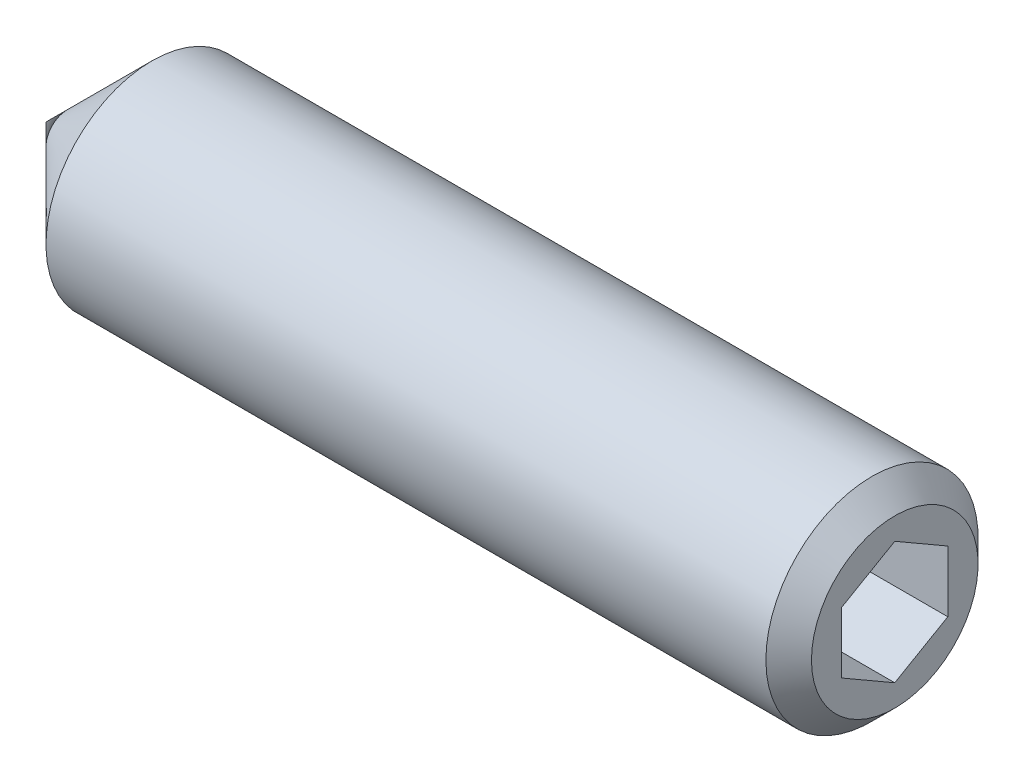
ISO-10303-21;
HEADER;
FILE_DESCRIPTION(('STEP AP214'),'2;1');
FILE_NAME('part.step','',(''),(''),'','','');
FILE_SCHEMA(('AUTOMOTIVE_DESIGN { 1 0 10303 214 1 1 1 1 }'));
ENDSEC;
DATA;
#1=APPLICATION_CONTEXT('core data for automotive mechanical design processes');
#2=APPLICATION_PROTOCOL_DEFINITION('international standard','automotive_design',2000,#1);
#3=PRODUCT_CONTEXT('',#1,'mechanical');
#4=PRODUCT('Part','Part','',(#3));
#5=PRODUCT_RELATED_PRODUCT_CATEGORY('part','',(#4));
#6=PRODUCT_DEFINITION_FORMATION('','',#4);
#7=PRODUCT_DEFINITION_CONTEXT('part definition',#1,'design');
#8=PRODUCT_DEFINITION('design','',#6,#7);
#9=PRODUCT_DEFINITION_SHAPE('','',#8);
#10=(LENGTH_UNIT() NAMED_UNIT(*) SI_UNIT(.MILLI.,.METRE.));
#11=(NAMED_UNIT(*) PLANE_ANGLE_UNIT() SI_UNIT($,.RADIAN.));
#12=(NAMED_UNIT(*) SI_UNIT($,.STERADIAN.) SOLID_ANGLE_UNIT());
#13=UNCERTAINTY_MEASURE_WITH_UNIT(LENGTH_MEASURE(1.E-05),#10,'distance_accuracy_value','');
#14=(GEOMETRIC_REPRESENTATION_CONTEXT(3) GLOBAL_UNCERTAINTY_ASSIGNED_CONTEXT((#13)) GLOBAL_UNIT_ASSIGNED_CONTEXT((#10,
#11,#12)) REPRESENTATION_CONTEXT('',''));
#15=CARTESIAN_POINT('',(0.,0.,0.));
#16=DIRECTION('',(0.,0.,1.));
#17=DIRECTION('',(1.,0.,0.));
#18=AXIS2_PLACEMENT_3D('',#15,#16,#17);
#19=CARTESIAN_POINT('',(16.,-0.577350269189623,-0.999999999999998));
#20=DIRECTION('',(0.,0.,-1.));
#21=DIRECTION('',(-1.,0.,0.));
#22=AXIS2_PLACEMENT_3D('',#19,#20,#21);
#23=PLANE('',#22);
#24=DIRECTION('',(1.,0.,0.));
#25=VECTOR('',#24,1.);
#26=CARTESIAN_POINT('',(16.,-0.577350269189624,-0.999999999999995));
#27=LINE('',#26,#25);
#28=CARTESIAN_POINT('',(13.5000000009061,-0.57735026912423,-0.999999999886733));
#29=VERTEX_POINT('',#28);
#30=CARTESIAN_POINT('',(16.,-0.577350269189624,-0.999999999999996));
#31=VERTEX_POINT('',#30);
#32=EDGE_CURVE('E76',#29,#31,#27,.T.);
#33=ORIENTED_EDGE('',*,*,#32,.T.);
#34=DIRECTION('',(0.,1.,0.));
#35=VECTOR('',#34,1.);
#36=CARTESIAN_POINT('',(16.,-0.577350269189623,-0.999999999999998));
#37=LINE('',#36,#35);
#38=CARTESIAN_POINT('',(16.,0.577350269189624,-0.999999999999996));
#39=VERTEX_POINT('',#38);
#40=EDGE_CURVE('E82',#39,#31,#37,.F.);
#41=ORIENTED_EDGE('',*,*,#40,.F.);
#42=DIRECTION('',(1.,0.,0.));
#43=VECTOR('',#42,1.);
#44=CARTESIAN_POINT('',(16.,0.577350269189624,-0.999999999999995));
#45=LINE('',#44,#43);
#46=CARTESIAN_POINT('',(13.5000000009439,0.577350269058838,-0.999999999999997));
#47=VERTEX_POINT('',#46);
#48=EDGE_CURVE('E79',#39,#47,#45,.F.);
#49=ORIENTED_EDGE('',*,*,#48,.T.);
#50=CARTESIAN_POINT('',(13.5000000007965,-0.5773502689597,-1.00000000018141));
#51=CARTESIAN_POINT('',(13.4853477733828,-0.526608173396974,-1.00000000006515));
#52=CARTESIAN_POINT('',(13.4720223393553,-0.475428072795128,-1.00000000001746));
#53=CARTESIAN_POINT('',(13.4487631944525,-0.372181722387194,-0.999999999982494));
#54=CARTESIAN_POINT('',(13.438837710883,-0.320113638690416,-0.999999999995364));
#55=CARTESIAN_POINT('',(13.4233879801396,-0.216622724957149,-1.00000000000452));
#56=CARTESIAN_POINT('',(13.4177608944549,-0.165215813863969,-1.0000000000012));
#57=CARTESIAN_POINT('',(13.4110445847173,-0.0621602313734194,-0.999999999998795));
#58=CARTESIAN_POINT('',(13.4099497976449,-0.0105119342980575,-0.999999999999696));
#59=CARTESIAN_POINT('',(13.4122331457619,0.0859873680358365,-1.00000000000026));
#60=CARTESIAN_POINT('',(13.4150506433072,0.130852853801168,-1.00000000000007));
#61=CARTESIAN_POINT('',(13.4239786510911,0.220291541325074,-0.999999999999927));
#62=CARTESIAN_POINT('',(13.4300922081347,0.264864433969996,-0.999999999999978));
#63=CARTESIAN_POINT('',(13.4453749174606,0.354487373624506,-1.00000000000002));
#64=CARTESIAN_POINT('',(13.4546088219235,0.39952608336362,-1.00000000000001));
#65=CARTESIAN_POINT('',(13.4755658812825,0.488931944768837,-0.999999999999988));
#66=CARTESIAN_POINT('',(13.4872841152643,0.533300240943821,-0.999999999999977));
#67=CARTESIAN_POINT('',(13.5000000009144,0.577350268956905,-0.999999999999998));
#68=B_SPLINE_CURVE_WITH_KNOTS('',3,(#50,#51,#52,#53,#54,#55,#56,#57,#58,#59,#60,#61,#62,#63,#64,
#65,#66,#67),.UNSPECIFIED.,.F.,.F.,(4,2,2,2,2,2,2,2,4),(0.,0.158508005822943,0.317396908609176,
0.472353803200606,0.627120444598494,0.76185389132548,0.896712096768139,1.03456081098711,
1.1721389863695),.UNSPECIFIED.);
#69=EDGE_CURVE('E19',#29,#47,#68,.T.);
#70=ORIENTED_EDGE('',*,*,#69,.F.);
#71=EDGE_LOOP('',(#33,#41,#49,#70));
#72=FACE_BOUND('',#71,.T.);
#73=ADVANCED_FACE('F15',(#72),#23,.F.);
#74=CARTESIAN_POINT('',(16.,-1.15470053837925,0.));
#75=DIRECTION('',(0.,-0.866025403784437,-0.500000000000003));
#76=DIRECTION('',(0.,0.500000000000003,-0.866025403784437));
#77=AXIS2_PLACEMENT_3D('',#74,#75,#76);
#78=PLANE('',#77);
#79=DIRECTION('',(1.,0.,0.));
#80=VECTOR('',#79,1.);
#81=CARTESIAN_POINT('',(16.,-1.15470053837925,0.));
#82=LINE('',#81,#80);
#83=CARTESIAN_POINT('',(13.5000000009442,-1.15470053831437,-1.12366323968362E-10));
#84=VERTEX_POINT('',#83);
#85=CARTESIAN_POINT('',(16.,-1.15470053837925,0.));
#86=VERTEX_POINT('',#85);
#87=EDGE_CURVE('E143',#84,#86,#82,.T.);
#88=ORIENTED_EDGE('',*,*,#87,.T.);
#89=DIRECTION('',(0.,0.500000000000003,-0.866025403784437));
#90=VECTOR('',#89,1.);
#91=CARTESIAN_POINT('',(16.,-1.15470053837925,0.));
#92=LINE('',#91,#90);
#93=EDGE_CURVE('E92',#31,#86,#92,.F.);
#94=ORIENTED_EDGE('',*,*,#93,.F.);
#95=ORIENTED_EDGE('',*,*,#32,.F.);
#96=CARTESIAN_POINT('',(13.5000000007962,-1.15470053842382,-2.88539661826296E-10));
#97=CARTESIAN_POINT('',(13.4853477733831,-1.12932949054092,-0.0439439440286092));
#98=CARTESIAN_POINT('',(13.4720223393557,-1.10373944019836,-0.0882672112940233));
#99=CARTESIAN_POINT('',(13.448763194453,-1.05211626496388,-0.177681173577662));
#100=CARTESIAN_POINT('',(13.4388377108834,-1.02608222312676,-0.222773456791887));
#101=CARTESIAN_POINT('',(13.4233879801399,-0.97433676626815,-0.31239921715031));
#102=CARTESIAN_POINT('',(13.4177608944551,-0.948633310718676,-0.356918908085404));
#103=CARTESIAN_POINT('',(13.4110445847174,-0.89710551947132,-0.446167660522774));
#104=CARTESIAN_POINT('',(13.4099497976449,-0.871281370934437,-0.490896397852677));
#105=CARTESIAN_POINT('',(13.4122331457618,-0.823031719767888,-0.574467245121751));
#106=CARTESIAN_POINT('',(13.415050643307,-0.80059897688495,-0.613321895547742));
#107=CARTESIAN_POINT('',(13.4239786510909,-0.755879633122663,-0.690778071024876));
#108=CARTESIAN_POINT('',(13.4300922081345,-0.73359318680014,-0.729379328375744));
#109=CARTESIAN_POINT('',(13.4453749174604,-0.68878171697271,-0.806995070878776));
#110=CARTESIAN_POINT('',(13.4546088219234,-0.666262362103039,-0.845999737666698));
#111=CARTESIAN_POINT('',(13.4755658812824,-0.621559431400207,-0.923427484891191));
#112=CARTESIAN_POINT('',(13.4872841152642,-0.599375283312605,-0.961851556501527));
#113=CARTESIAN_POINT('',(13.5000000009144,-0.577350269305983,-0.999999999798456));
#114=B_SPLINE_CURVE_WITH_KNOTS('',3,(#96,#97,#98,#99,#100,#101,#102,#103,#104,#105,#106,#107,
#108,#109,#110,#111,#112,#113),.UNSPECIFIED.,.F.,.F.,(4,2,2,2,2,2,2,2,4),(0.,0.158508005822828,
0.317396908608979,0.472353803200362,0.62712044459819,0.761853891325792,0.896712096769076,
1.03456081098868,1.17213898637169),.UNSPECIFIED.);
#115=EDGE_CURVE('E84',#84,#29,#114,.T.);
#116=ORIENTED_EDGE('',*,*,#115,.F.);
#117=EDGE_LOOP('',(#88,#94,#95,#116));
#118=FACE_BOUND('',#117,.T.);
#119=ADVANCED_FACE('F93',(#118),#78,.F.);
#120=CARTESIAN_POINT('',(16.,0.577350269189624,-0.999999999999995));
#121=DIRECTION('',(0.,0.86602540378444,-0.499999999999998));
#122=DIRECTION('',(0.,0.499999999999998,0.86602540378444));
#123=AXIS2_PLACEMENT_3D('',#120,#121,#122);
#124=PLANE('',#123);
#125=ORIENTED_EDGE('',*,*,#48,.F.);
#126=DIRECTION('',(0.,0.499999999999998,0.86602540378444));
#127=VECTOR('',#126,1.);
#128=CARTESIAN_POINT('',(16.,0.577350269189624,-0.999999999999995));
#129=LINE('',#128,#127);
#130=CARTESIAN_POINT('',(16.,1.15470053837925,0.));
#131=VERTEX_POINT('',#130);
#132=EDGE_CURVE('E91',#131,#39,#129,.F.);
#133=ORIENTED_EDGE('',*,*,#132,.F.);
#134=DIRECTION('',(1.,0.,0.));
#135=VECTOR('',#134,1.);
#136=CARTESIAN_POINT('',(16.,1.15470053837925,0.));
#137=LINE('',#136,#135);
#138=CARTESIAN_POINT('',(13.500000005755,1.15470054664694,1.43200663951747E-08));
#139=VERTEX_POINT('',#138);
#140=EDGE_CURVE('E188',#131,#139,#137,.F.);
#141=ORIENTED_EDGE('',*,*,#140,.T.);
#142=CARTESIAN_POINT('',(13.5000000007965,0.577350269461692,-0.999999999891582));
#143=CARTESIAN_POINT('',(13.4853477733803,0.60272131714682,-0.956056056027174));
#144=CARTESIAN_POINT('',(13.4720223393506,0.628311367410942,-0.911732788706088));
#145=CARTESIAN_POINT('',(13.4487631944447,0.679934542594335,-0.82231882637049));
#146=CARTESIAN_POINT('',(13.4388377108742,0.705968584459085,-0.777226543160107));
#147=CARTESIAN_POINT('',(13.4233879801338,0.757714041334431,-0.68760078280945));
#148=CARTESIAN_POINT('',(13.4177608944515,0.783417496873599,-0.643081091878893));
#149=CARTESIAN_POINT('',(13.4110445847168,0.834945288106863,-0.553832339456262));
#150=CARTESIAN_POINT('',(13.4099497976448,0.860769436639948,-0.509103602136557));
#151=CARTESIAN_POINT('',(13.4122331458169,0.909019088958287,-0.425532752874788));
#152=CARTESIAN_POINT('',(13.4150506435983,0.931451832994588,-0.386678100450343));
#153=CARTESIAN_POINT('',(13.4239786521792,0.976171179044848,-0.309221921009753));
#154=CARTESIAN_POINT('',(13.4300922097846,0.998457626501937,-0.270620661693963));
#155=CARTESIAN_POINT('',(13.445374920511,1.04326909862466,-0.193004915215536));
#156=CARTESIAN_POINT('',(13.454608825823,1.06578845465392,-0.154000246419093));
#157=CARTESIAN_POINT('',(13.4755658870645,1.11049138763376,-0.076572495250633));
#158=CARTESIAN_POINT('',(13.4872841220789,1.13267553683892,-0.0381484217045874));
#159=CARTESIAN_POINT('',(13.5000000088152,1.15470055194748,2.3500875048389E-08));
#160=B_SPLINE_CURVE_WITH_KNOTS('',3,(#142,#143,#144,#145,#146,#147,#148,#149,#150,#151,#152,
#153,#154,#155,#156,#157,#158,#159),.UNSPECIFIED.,.F.,.F.,(4,2,2,2,2,2,2,2,4),(0.,
0.158508005850633,0.317396908668114,0.472353803231372,0.627120444598506,0.761853898258118,
0.896712110659052,1.03456083219764,1.17213901484391),.UNSPECIFIED.);
#161=EDGE_CURVE('E138',#47,#139,#160,.T.);
#162=ORIENTED_EDGE('',*,*,#161,.F.);
#163=EDGE_LOOP('',(#125,#133,#141,#162));
#164=FACE_BOUND('',#163,.T.);
#165=ADVANCED_FACE('F144',(#164),#124,.F.);
#166=CARTESIAN_POINT('',(16.,-0.577350269189628,0.999999999999995));
#167=DIRECTION('',(0.,-0.86602540378444,0.499999999999998));
#168=DIRECTION('',(0.,-0.499999999999998,-0.86602540378444));
#169=AXIS2_PLACEMENT_3D('',#166,#167,#168);
#170=PLANE('',#169);
#171=DIRECTION('',(1.,0.,0.));
#172=VECTOR('',#171,1.);
#173=CARTESIAN_POINT('',(16.,-0.57735026918963,0.999999999999998));
#174=LINE('',#173,#172);
#175=CARTESIAN_POINT('',(13.4999999932102,-0.577350307439129,0.999999962373884));
#176=VERTEX_POINT('',#175);
#177=CARTESIAN_POINT('',(16.,-0.577350269189628,0.999999999999998));
#178=VERTEX_POINT('',#177);
#179=EDGE_CURVE('E196',#176,#178,#174,.T.);
#180=ORIENTED_EDGE('',*,*,#179,.T.);
#181=DIRECTION('',(0.,-0.499999999999998,-0.86602540378444));
#182=VECTOR('',#181,1.);
#183=CARTESIAN_POINT('',(16.,-0.577350269189628,0.999999999999995));
#184=LINE('',#183,#182);
#185=EDGE_CURVE('E189',#86,#178,#184,.F.);
#186=ORIENTED_EDGE('',*,*,#185,.F.);
#187=ORIENTED_EDGE('',*,*,#87,.F.);
#188=CARTESIAN_POINT('',(13.5000000007962,-1.15470053842382,2.88539057208724E-10));
#189=CARTESIAN_POINT('',(13.4853477733911,-1.12932949055499,0.043943944004229));
#190=CARTESIAN_POINT('',(13.4720223393704,-1.10373944022668,0.0882672112449615));
#191=CARTESIAN_POINT('',(13.4487631944777,-1.05211626502294,0.177681173475374));
#192=CARTESIAN_POINT('',(13.4388377109111,-1.02608222320232,0.222773456661006));
#193=CARTESIAN_POINT('',(13.4233879801582,-0.9743367663462,0.312399217015122));
#194=CARTESIAN_POINT('',(13.4177608944659,-0.948633310782322,0.356918907975165));
#195=CARTESIAN_POINT('',(13.4110445847192,-0.897105519503549,0.446167660466951));
#196=CARTESIAN_POINT('',(13.4099497976454,-0.871281370949646,0.490896397826334));
#197=CARTESIAN_POINT('',(13.4122331455876,-0.823031723426098,0.574467238785548));
#198=CARTESIAN_POINT('',(13.4150506423855,-0.800598984195331,0.613321882885794));
#199=CARTESIAN_POINT('',(13.4239786476465,-0.755879647676699,0.69077804581655));
#200=CARTESIAN_POINT('',(13.4300922029122,-0.733593204945517,0.729379296947033));
#201=CARTESIAN_POINT('',(13.4453749078048,-0.688781742383897,0.806995026865313));
#202=CARTESIAN_POINT('',(13.4546088095804,-0.66626239118513,0.845999687295043));
#203=CARTESIAN_POINT('',(13.4755658629802,-0.621559467690542,0.923427422034494));
#204=CARTESIAN_POINT('',(13.4872840936937,-0.599375323140763,0.961851487517142));
#205=CARTESIAN_POINT('',(13.4999999759057,-0.577350312622353,0.999999924772309));
#206=B_SPLINE_CURVE_WITH_KNOTS('',3,(#188,#189,#190,#191,#192,#193,#194,#195,#196,#197,#198,
#199,#200,#201,#202,#203,#204,#205),.UNSPECIFIED.,.F.,.F.,(4,2,2,2,2,2,2,2,4),(0.,
0.158508005735175,0.317396908422416,0.472353803102973,0.627120444598144,0.761853869381642,
0.896712052799638,1.03456074385019,1.17213889624056),.UNSPECIFIED.);
#207=EDGE_CURVE('E87',#84,#176,#206,.T.);
#208=ORIENTED_EDGE('',*,*,#207,.T.);
#209=EDGE_LOOP('',(#180,#186,#187,#208));
#210=FACE_BOUND('',#209,.T.);
#211=ADVANCED_FACE('F147',(#210),#170,.F.);
#212=CARTESIAN_POINT('',(16.,1.15470053837925,0.));
#213=DIRECTION('',(0.,0.866025403784437,0.500000000000003));
#214=DIRECTION('',(0.,-0.500000000000003,0.866025403784437));
#215=AXIS2_PLACEMENT_3D('',#212,#213,#214);
#216=PLANE('',#215);
#217=ORIENTED_EDGE('',*,*,#140,.F.);
#218=DIRECTION('',(0.,-0.500000000000003,0.866025403784437));
#219=VECTOR('',#218,1.);
#220=CARTESIAN_POINT('',(16.,1.15470053837925,0.));
#221=LINE('',#220,#219);
#222=CARTESIAN_POINT('',(16.,0.577350269189619,0.999999999999998));
#223=VERTEX_POINT('',#222);
#224=EDGE_CURVE('E179',#223,#131,#221,.F.);
#225=ORIENTED_EDGE('',*,*,#224,.F.);
#226=DIRECTION('',(1.,0.,0.));
#227=VECTOR('',#226,1.);
#228=CARTESIAN_POINT('',(16.,0.577350269189619,0.999999999999998));
#229=LINE('',#228,#227);
#230=CARTESIAN_POINT('',(13.4999999884389,0.577350290914179,0.999999962371955));
#231=VERTEX_POINT('',#230);
#232=EDGE_CURVE('E110',#223,#231,#229,.F.);
#233=ORIENTED_EDGE('',*,*,#232,.T.);
#234=CARTESIAN_POINT('',(13.4999999757877,0.577350312778571,0.999999924860814));
#235=CARTESIAN_POINT('',(13.4853477504275,0.602721359729243,0.95605598227091));
#236=CARTESIAN_POINT('',(13.4720223185816,0.628311409253599,0.911732716232116));
#237=CARTESIAN_POINT('',(13.4487631782071,0.67993458288393,0.822318756587217));
#238=CARTESIAN_POINT('',(13.4388376969814,0.705968623934907,0.77722647478607));
#239=CARTESIAN_POINT('',(13.4233879708716,0.757714079224424,0.687600717181961));
#240=CARTESIAN_POINT('',(13.4177608874906,0.783417533994877,0.643081027582927));
#241=CARTESIAN_POINT('',(13.4110445822059,0.834945323601938,0.553832277977012));
#242=CARTESIAN_POINT('',(13.4099497972843,0.860769471277717,0.509103542142186));
#243=CARTESIAN_POINT('',(13.4122331488003,0.909019115125361,0.425532707552082));
#244=CARTESIAN_POINT('',(13.4150506467618,0.931451851573332,0.386678068271015));
#245=CARTESIAN_POINT('',(13.423978653419,0.97617118251772,0.309221914994568));
#246=CARTESIAN_POINT('',(13.4300922089153,0.998457622457517,0.270620668699108));
#247=CARTESIAN_POINT('',(13.4453749134107,1.04326907933696,0.193004948622811));
#248=CARTESIAN_POINT('',(13.4546088145284,1.06578842764704,0.154000293196401));
#249=CARTESIAN_POINT('',(13.4755658659255,1.11049134545321,0.0765725683094835));
#250=CARTESIAN_POINT('',(13.4872840952971,1.13267548720297,0.0381485076765692));
#251=CARTESIAN_POINT('',(13.4999999759167,1.15470049496554,7.51947456425653E-08));
#252=B_SPLINE_CURVE_WITH_KNOTS('',3,(#234,#235,#236,#237,#238,#239,#240,#241,#242,#243,#244,
#245,#246,#247,#248,#249,#250,#251),.UNSPECIFIED.,.F.,.F.,(4,2,2,2,2,2,2,2,4),(0.,
0.158507999891464,0.317396896583745,0.472353785810337,0.62712042190813,0.761853830305226,
0.896711997273537,1.03456067098278,1.17213880614263),.UNSPECIFIED.);
#253=EDGE_CURVE('E134',#231,#139,#252,.T.);
#254=ORIENTED_EDGE('',*,*,#253,.T.);
#255=EDGE_LOOP('',(#217,#225,#233,#254));
#256=FACE_BOUND('',#255,.T.);
#257=ADVANCED_FACE('F122',(#256),#216,.F.);
#258=CARTESIAN_POINT('',(13.504000000637,0.,0.));
#259=DIRECTION('',(1.,0.,0.));
#260=DIRECTION('',(0.,0.,-1.));
#261=AXIS2_PLACEMENT_3D('',#258,#259,#260);
#262=CONICAL_SURFACE('',#261,1.16162874098791,1.04719754964988);
#263=CARTESIAN_POINT('',(12.8333333323098,-2.27373675443232E-10,0.));
#264=VERTEX_POINT('',#263);
#265=VERTEX_LOOP('',#264);
#266=FACE_BOUND('',#265,.T.);
#267=ORIENTED_EDGE('',*,*,#207,.F.);
#268=ORIENTED_EDGE('',*,*,#115,.T.);
#269=ORIENTED_EDGE('',*,*,#69,.T.);
#270=ORIENTED_EDGE('',*,*,#161,.T.);
#271=ORIENTED_EDGE('',*,*,#253,.F.);
#272=CARTESIAN_POINT('',(13.5000000330867,0.577350295732967,0.999999962665912));
#273=CARTESIAN_POINT('',(13.4853477896379,0.526608201288083,0.999999986591268));
#274=CARTESIAN_POINT('',(13.4720223482787,0.475428099530079,0.999999996406233));
#275=CARTESIAN_POINT('',(13.4487631966339,0.372181744968924,1.0000000036024));
#276=CARTESIAN_POINT('',(13.4388377136581,0.320113658273451,1.00000000095367));
#277=CARTESIAN_POINT('',(13.4233879824546,0.216622739489758,0.999999999069931));
#278=CARTESIAN_POINT('',(13.4177608957238,0.16521582633937,0.999999999752072));
#279=CARTESIAN_POINT('',(13.4110445847891,0.0621602394518668,1.00000000024762));
#280=CARTESIAN_POINT('',(13.4099497975729,0.0105119400364327,1.00000000006209));
#281=CARTESIAN_POINT('',(13.4122331456843,-0.0859873671139308,0.99999999994594));
#282=CARTESIAN_POINT('',(13.4150506433724,-0.130852855359603,0.999999999985427));
#283=CARTESIAN_POINT('',(13.4239786518237,-0.220291547758401,1.00000000001458));
#284=CARTESIAN_POINT('',(13.4300922093885,-0.264864442798225,1.0000000000042));
#285=CARTESIAN_POINT('',(13.4453749200933,-0.354487387552403,0.999999999995699));
#286=CARTESIAN_POINT('',(13.4546088254416,-0.399526099990973,0.999999999997851));
#287=CARTESIAN_POINT('',(13.4755658868214,-0.488931966782026,1.00000000000214));
#288=CARTESIAN_POINT('',(13.4872841219421,-0.533300265642657,1.00000000000428));
#289=CARTESIAN_POINT('',(13.5000000088089,-0.577350296303989,0.999999999999998));
#290=B_SPLINE_CURVE_WITH_KNOTS('',3,(#272,#273,#274,#275,#276,#277,#278,#279,#280,#281,#282,
#283,#284,#285,#286,#287,#288,#289),.UNSPECIFIED.,.F.,.F.,(4,2,2,2,2,2,2,2,4),(0.,
0.158508014661023,0.317396925616527,0.472353826849153,0.627120475165851,0.761853929347488,
0.896712142096484,1.03456086477329,1.17213904880585),.UNSPECIFIED.);
#291=EDGE_CURVE('E104',#231,#176,#290,.T.);
#292=ORIENTED_EDGE('',*,*,#291,.T.);
#293=EDGE_LOOP('',(#267,#268,#269,#270,#271,#292));
#294=FACE_BOUND('',#293,.T.);
#295=ADVANCED_FACE('F85',(#266,#294),#262,.F.);
#296=CARTESIAN_POINT('',(16.,0.577350269189619,0.999999999999998));
#297=DIRECTION('',(0.,0.,1.));
#298=DIRECTION('',(1.,0.,0.));
#299=AXIS2_PLACEMENT_3D('',#296,#297,#298);
#300=PLANE('',#299);
#301=ORIENTED_EDGE('',*,*,#232,.F.);
#302=DIRECTION('',(0.,1.,0.));
#303=VECTOR('',#302,1.);
#304=CARTESIAN_POINT('',(16.,0.,0.999999999999998));
#305=LINE('',#304,#303);
#306=EDGE_CURVE('E103',#223,#178,#305,.F.);
#307=ORIENTED_EDGE('',*,*,#306,.T.);
#308=ORIENTED_EDGE('',*,*,#179,.F.);
#309=ORIENTED_EDGE('',*,*,#291,.F.);
#310=EDGE_LOOP('',(#301,#307,#308,#309));
#311=FACE_BOUND('',#310,.T.);
#312=ADVANCED_FACE('F116',(#311),#300,.F.);
#313=CARTESIAN_POINT('',(16.,0.,0.));
#314=DIRECTION('',(-1.,0.,0.));
#315=DIRECTION('',(0.,0.,1.));
#316=AXIS2_PLACEMENT_3D('',#313,#314,#315);
#317=PLANE('',#316);
#318=ORIENTED_EDGE('',*,*,#224,.T.);
#319=ORIENTED_EDGE('',*,*,#132,.T.);
#320=ORIENTED_EDGE('',*,*,#40,.T.);
#321=ORIENTED_EDGE('',*,*,#93,.T.);
#322=ORIENTED_EDGE('',*,*,#185,.T.);
#323=ORIENTED_EDGE('',*,*,#306,.F.);
#324=EDGE_LOOP('',(#318,#319,#320,#321,#322,#323));
#325=FACE_BOUND('',#324,.T.);
#326=CARTESIAN_POINT('',(16.0000000002469,0.,0.));
#327=DIRECTION('',(-1.,0.,0.));
#328=DIRECTION('',(0.,0.,1.));
#329=AXIS2_PLACEMENT_3D('',#326,#327,#328);
#330=CIRCLE('',#329,1.57058500025187);
#331=CARTESIAN_POINT('',(16.0000000002469,0.,1.57058500025187));
#332=VERTEX_POINT('',#331);
#333=EDGE_CURVE('E100',#332,#332,#330,.T.);
#334=ORIENTED_EDGE('',*,*,#333,.F.);
#335=EDGE_LOOP('',(#334));
#336=FACE_BOUND('',#335,.T.);
#337=ADVANCED_FACE('F170',(#325,#336),#317,.F.);
#338=CARTESIAN_POINT('',(1.99999500000558,0.,0.));
#339=DIRECTION('',(1.,0.,0.));
#340=DIRECTION('',(0.,0.,-1.));
#341=AXIS2_PLACEMENT_3D('',#338,#339,#340);
#342=CONICAL_SURFACE('',#341,2.00000000006639,0.785399412504716);
#343=CARTESIAN_POINT('',(-3.63797880709171E-09,0.,0.));
#344=VERTEX_POINT('',#343);
#345=VERTEX_LOOP('',#344);
#346=FACE_BOUND('',#345,.T.);
#347=CARTESIAN_POINT('',(1.999995,0.,0.));
#348=DIRECTION('',(1.,0.,0.));
#349=DIRECTION('',(0.,1.,0.));
#350=AXIS2_PLACEMENT_3D('',#347,#348,#349);
#351=CIRCLE('',#350,2.);
#352=CARTESIAN_POINT('',(1.999995,2.,0.));
#353=VERTEX_POINT('',#352);
#354=EDGE_CURVE('E29',#353,#353,#351,.T.);
#355=ORIENTED_EDGE('',*,*,#354,.F.);
#356=EDGE_LOOP('',(#355));
#357=FACE_BOUND('',#356,.T.);
#358=ADVANCED_FACE('F164',(#346,#357),#342,.T.);
#359=CARTESIAN_POINT('',(15.5705849999208,0.,0.));
#360=DIRECTION('',(-1.,0.,0.));
#361=DIRECTION('',(0.,0.,1.));
#362=AXIS2_PLACEMENT_3D('',#359,#360,#361);
#363=CONICAL_SURFACE('',#362,1.99999999983902,0.785398162537017);
#364=ORIENTED_EDGE('',*,*,#333,.T.);
#365=EDGE_LOOP('',(#364));
#366=FACE_BOUND('',#365,.T.);
#367=CARTESIAN_POINT('',(15.570585,0.,0.));
#368=DIRECTION('',(1.,0.,0.));
#369=DIRECTION('',(0.,1.,0.));
#370=AXIS2_PLACEMENT_3D('',#367,#368,#369);
#371=CIRCLE('',#370,2.);
#372=CARTESIAN_POINT('',(15.570585,2.,0.));
#373=VERTEX_POINT('',#372);
#374=EDGE_CURVE('E10',#373,#373,#371,.F.);
#375=ORIENTED_EDGE('',*,*,#374,.F.);
#376=EDGE_LOOP('',(#375));
#377=FACE_BOUND('',#376,.T.);
#378=ADVANCED_FACE('F158',(#366,#377),#363,.T.);
#379=CARTESIAN_POINT('',(7.99999999999999,0.,0.));
#380=DIRECTION('',(1.,0.,0.));
#381=DIRECTION('',(0.,1.,0.));
#382=AXIS2_PLACEMENT_3D('',#379,#380,#381);
#383=CYLINDRICAL_SURFACE('',#382,2.);
#384=ORIENTED_EDGE('',*,*,#374,.T.);
#385=EDGE_LOOP('',(#384));
#386=FACE_BOUND('',#385,.T.);
#387=ORIENTED_EDGE('',*,*,#354,.T.);
#388=EDGE_LOOP('',(#387));
#389=FACE_BOUND('',#388,.T.);
#390=ADVANCED_FACE('F156',(#386,#389),#383,.T.);
#391=CLOSED_SHELL('',(#73,#119,#165,#211,#257,#295,#312,#337,#358,#378,#390));
#392=MANIFOLD_SOLID_BREP('B1',#391);
#393=ADVANCED_BREP_SHAPE_REPRESENTATION('',(#18,#392),#14);
#394=SHAPE_DEFINITION_REPRESENTATION(#9,#393);
ENDSEC;
END-ISO-10303-21;
